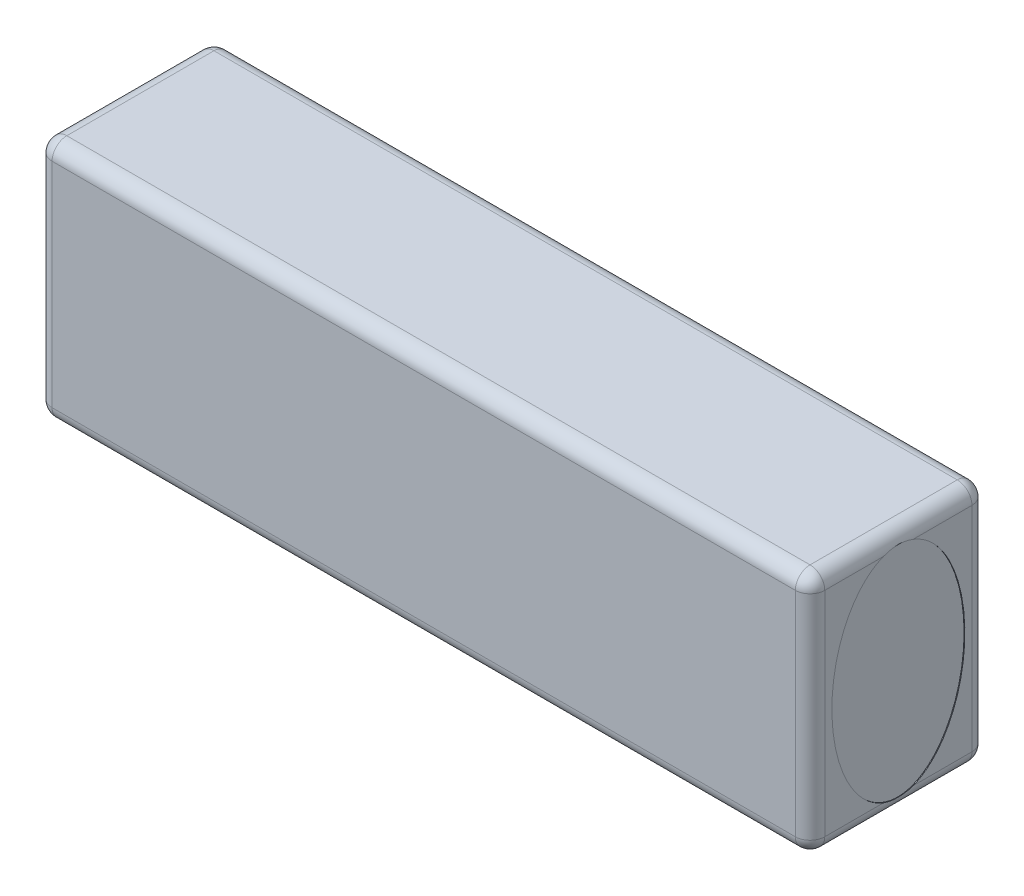
ISO-10303-21;
HEADER;
FILE_DESCRIPTION(('STEP AP214'),'2;1');
FILE_NAME('part.step','',(''),(''),'','','');
FILE_SCHEMA(('AUTOMOTIVE_DESIGN { 1 0 10303 214 1 1 1 1 }'));
ENDSEC;
DATA;
#1=APPLICATION_CONTEXT('core data for automotive mechanical design processes');
#2=APPLICATION_PROTOCOL_DEFINITION('international standard','automotive_design',2000,#1);
#3=PRODUCT_CONTEXT('',#1,'mechanical');
#4=PRODUCT('Part','Part','',(#3));
#5=PRODUCT_RELATED_PRODUCT_CATEGORY('part','',(#4));
#6=PRODUCT_DEFINITION_FORMATION('','',#4);
#7=PRODUCT_DEFINITION_CONTEXT('part definition',#1,'design');
#8=PRODUCT_DEFINITION('design','',#6,#7);
#9=PRODUCT_DEFINITION_SHAPE('','',#8);
#10=(LENGTH_UNIT() NAMED_UNIT(*) SI_UNIT(.MILLI.,.METRE.));
#11=(NAMED_UNIT(*) PLANE_ANGLE_UNIT() SI_UNIT($,.RADIAN.));
#12=(NAMED_UNIT(*) SI_UNIT($,.STERADIAN.) SOLID_ANGLE_UNIT());
#13=UNCERTAINTY_MEASURE_WITH_UNIT(LENGTH_MEASURE(1.E-05),#10,'distance_accuracy_value','');
#14=(GEOMETRIC_REPRESENTATION_CONTEXT(3) GLOBAL_UNCERTAINTY_ASSIGNED_CONTEXT((#13)) GLOBAL_UNIT_ASSIGNED_CONTEXT((#10,
#11,#12)) REPRESENTATION_CONTEXT('',''));
#15=CARTESIAN_POINT('',(0.,0.,0.));
#16=DIRECTION('',(0.,0.,1.));
#17=DIRECTION('',(1.,0.,0.));
#18=AXIS2_PLACEMENT_3D('',#15,#16,#17);
#19=CARTESIAN_POINT('',(105.,0.,24.));
#20=DIRECTION('',(-1.,0.,0.));
#21=DIRECTION('',(0.,0.,1.));
#22=AXIS2_PLACEMENT_3D('',#19,#20,#21);
#23=PLANE('',#22);
#24=CARTESIAN_POINT('',(105.,16.5,12.));
#25=DIRECTION('',(-1.,0.,0.));
#26=DIRECTION('',(0.,1.,0.));
#27=AXIS2_PLACEMENT_3D('',#24,#25,#26);
#28=ELLIPSE('',#27,14.8700467628967,9.03232292091459);
#29=CARTESIAN_POINT('',(105.,31.,9.9975220371461));
#30=VERTEX_POINT('',#29);
#31=CARTESIAN_POINT('',(105.,2.,9.9975220371461));
#32=VERTEX_POINT('',#31);
#33=EDGE_CURVE('E236',#30,#32,#28,.T.);
#34=ORIENTED_EDGE('',*,*,#33,.T.);
#35=DIRECTION('',(0.,0.,-1.));
#36=VECTOR('',#35,1.);
#37=CARTESIAN_POINT('',(105.,2.,24.));
#38=LINE('',#37,#36);
#39=CARTESIAN_POINT('',(105.,2.,2.));
#40=VERTEX_POINT('',#39);
#41=EDGE_CURVE('E322',#32,#40,#38,.T.);
#42=ORIENTED_EDGE('',*,*,#41,.T.);
#43=DIRECTION('',(0.,1.,0.));
#44=VECTOR('',#43,1.);
#45=CARTESIAN_POINT('',(105.,33.,2.));
#46=LINE('',#45,#44);
#47=CARTESIAN_POINT('',(105.,31.,2.));
#48=VERTEX_POINT('',#47);
#49=EDGE_CURVE('E321',#40,#48,#46,.T.);
#50=ORIENTED_EDGE('',*,*,#49,.T.);
#51=DIRECTION('',(0.,0.,-1.));
#52=VECTOR('',#51,1.);
#53=CARTESIAN_POINT('',(105.,31.,24.));
#54=LINE('',#53,#52);
#55=EDGE_CURVE('E319',#48,#30,#54,.F.);
#56=ORIENTED_EDGE('',*,*,#55,.T.);
#57=EDGE_LOOP('',(#34,#42,#50,#56));
#58=FACE_BOUND('',#57,.T.);
#59=ADVANCED_FACE('F33',(#58),#23,.F.);
#60=CARTESIAN_POINT('',(0.,0.,24.));
#61=DIRECTION('',(1.,0.,0.));
#62=DIRECTION('',(0.,0.,-1.));
#63=AXIS2_PLACEMENT_3D('',#60,#61,#62);
#64=PLANE('',#63);
#65=DIRECTION('',(0.,-1.,0.));
#66=VECTOR('',#65,1.);
#67=CARTESIAN_POINT('',(0.,0.,2.));
#68=LINE('',#67,#66);
#69=CARTESIAN_POINT('',(0.,31.,2.));
#70=VERTEX_POINT('',#69);
#71=CARTESIAN_POINT('',(0.,2.,2.));
#72=VERTEX_POINT('',#71);
#73=EDGE_CURVE('E200',#70,#72,#68,.T.);
#74=ORIENTED_EDGE('',*,*,#73,.T.);
#75=DIRECTION('',(0.,0.,-1.));
#76=VECTOR('',#75,1.);
#77=CARTESIAN_POINT('',(0.,2.,24.));
#78=LINE('',#77,#76);
#79=CARTESIAN_POINT('',(0.,2.,9.9975220371461));
#80=VERTEX_POINT('',#79);
#81=EDGE_CURVE('E202',#72,#80,#78,.F.);
#82=ORIENTED_EDGE('',*,*,#81,.T.);
#83=CARTESIAN_POINT('',(0.,16.5,12.));
#84=DIRECTION('',(-1.,0.,0.));
#85=DIRECTION('',(0.,1.,0.));
#86=AXIS2_PLACEMENT_3D('',#83,#84,#85);
#87=ELLIPSE('',#86,14.8700467628967,9.03232292091459);
#88=CARTESIAN_POINT('',(0.,31.,9.9975220371461));
#89=VERTEX_POINT('',#88);
#90=EDGE_CURVE('E186',#89,#80,#87,.T.);
#91=ORIENTED_EDGE('',*,*,#90,.F.);
#92=DIRECTION('',(0.,0.,-1.));
#93=VECTOR('',#92,1.);
#94=CARTESIAN_POINT('',(0.,31.,24.));
#95=LINE('',#94,#93);
#96=EDGE_CURVE('E198',#89,#70,#95,.T.);
#97=ORIENTED_EDGE('',*,*,#96,.T.);
#98=EDGE_LOOP('',(#74,#82,#91,#97));
#99=FACE_BOUND('',#98,.T.);
#100=ADVANCED_FACE('F291',(#99),#64,.F.);
#101=DIRECTION('',(0.,1.,0.));
#102=VECTOR('',#101,1.);
#103=CARTESIAN_POINT('',(105.,0.,22.));
#104=LINE('',#103,#102);
#105=CARTESIAN_POINT('',(105.,31.,22.));
#106=VERTEX_POINT('',#105);
#107=CARTESIAN_POINT('',(105.,2.,22.));
#108=VERTEX_POINT('',#107);
#109=EDGE_CURVE('E310',#106,#108,#104,.F.);
#110=ORIENTED_EDGE('',*,*,#109,.T.);
#111=DIRECTION('',(0.,0.,-1.));
#112=VECTOR('',#111,1.);
#113=CARTESIAN_POINT('',(105.,2.,24.));
#114=LINE('',#113,#112);
#115=CARTESIAN_POINT('',(105.,2.,14.0024779628539));
#116=VERTEX_POINT('',#115);
#117=EDGE_CURVE('E165',#108,#116,#114,.T.);
#118=ORIENTED_EDGE('',*,*,#117,.T.);
#119=CARTESIAN_POINT('',(105.,31.,14.0024779628539));
#120=VERTEX_POINT('',#119);
#121=EDGE_CURVE('E240',#116,#120,#28,.T.);
#122=ORIENTED_EDGE('',*,*,#121,.T.);
#123=DIRECTION('',(0.,0.,-1.));
#124=VECTOR('',#123,1.);
#125=CARTESIAN_POINT('',(105.,31.,24.));
#126=LINE('',#125,#124);
#127=EDGE_CURVE('E314',#120,#106,#126,.F.);
#128=ORIENTED_EDGE('',*,*,#127,.T.);
#129=EDGE_LOOP('',(#110,#118,#122,#128));
#130=FACE_BOUND('',#129,.T.);
#131=ADVANCED_FACE('F294',(#130),#23,.F.);
#132=CARTESIAN_POINT('',(0.,2.,14.0024779628539));
#133=VERTEX_POINT('',#132);
#134=CARTESIAN_POINT('',(0.,31.,14.0024779628539));
#135=VERTEX_POINT('',#134);
#136=EDGE_CURVE('E243',#133,#135,#87,.T.);
#137=ORIENTED_EDGE('',*,*,#136,.F.);
#138=DIRECTION('',(0.,0.,-1.));
#139=VECTOR('',#138,1.);
#140=CARTESIAN_POINT('',(0.,2.,24.));
#141=LINE('',#140,#139);
#142=CARTESIAN_POINT('',(0.,2.,22.));
#143=VERTEX_POINT('',#142);
#144=EDGE_CURVE('E196',#133,#143,#141,.F.);
#145=ORIENTED_EDGE('',*,*,#144,.T.);
#146=DIRECTION('',(0.,-1.,0.));
#147=VECTOR('',#146,1.);
#148=CARTESIAN_POINT('',(0.,0.,22.));
#149=LINE('',#148,#147);
#150=CARTESIAN_POINT('',(0.,31.,22.));
#151=VERTEX_POINT('',#150);
#152=EDGE_CURVE('E192',#143,#151,#149,.F.);
#153=ORIENTED_EDGE('',*,*,#152,.T.);
#154=DIRECTION('',(0.,0.,-1.));
#155=VECTOR('',#154,1.);
#156=CARTESIAN_POINT('',(0.,31.,24.));
#157=LINE('',#156,#155);
#158=EDGE_CURVE('E194',#151,#135,#157,.T.);
#159=ORIENTED_EDGE('',*,*,#158,.T.);
#160=EDGE_LOOP('',(#137,#145,#153,#159));
#161=FACE_BOUND('',#160,.T.);
#162=ADVANCED_FACE('F300',(#161),#64,.F.);
#163=CARTESIAN_POINT('',(0.,0.,24.));
#164=DIRECTION('',(0.,1.,0.));
#165=DIRECTION('',(0.,0.,1.));
#166=AXIS2_PLACEMENT_3D('',#163,#164,#165);
#167=PLANE('',#166);
#168=DIRECTION('',(0.,0.,-1.));
#169=VECTOR('',#168,1.);
#170=CARTESIAN_POINT('',(2.,0.,24.));
#171=LINE('',#170,#169);
#172=CARTESIAN_POINT('',(2.,0.,22.));
#173=VERTEX_POINT('',#172);
#174=CARTESIAN_POINT('',(2.,0.,2.));
#175=VERTEX_POINT('',#174);
#176=EDGE_CURVE('E157',#173,#175,#171,.T.);
#177=ORIENTED_EDGE('',*,*,#176,.T.);
#178=DIRECTION('',(1.,0.,0.));
#179=VECTOR('',#178,1.);
#180=CARTESIAN_POINT('',(105.,0.,2.));
#181=LINE('',#180,#179);
#182=CARTESIAN_POINT('',(103.,0.,2.));
#183=VERTEX_POINT('',#182);
#184=EDGE_CURVE('E153',#175,#183,#181,.T.);
#185=ORIENTED_EDGE('',*,*,#184,.T.);
#186=DIRECTION('',(0.,0.,-1.));
#187=VECTOR('',#186,1.);
#188=CARTESIAN_POINT('',(103.,0.,24.));
#189=LINE('',#188,#187);
#190=CARTESIAN_POINT('',(103.,0.,22.));
#191=VERTEX_POINT('',#190);
#192=EDGE_CURVE('E145',#183,#191,#189,.F.);
#193=ORIENTED_EDGE('',*,*,#192,.T.);
#194=DIRECTION('',(1.,0.,0.));
#195=VECTOR('',#194,1.);
#196=CARTESIAN_POINT('',(0.,0.,22.));
#197=LINE('',#196,#195);
#198=EDGE_CURVE('E150',#191,#173,#197,.F.);
#199=ORIENTED_EDGE('',*,*,#198,.T.);
#200=EDGE_LOOP('',(#177,#185,#193,#199));
#201=FACE_BOUND('',#200,.T.);
#202=ADVANCED_FACE('F148',(#201),#167,.F.);
#203=CARTESIAN_POINT('',(0.,33.,24.));
#204=DIRECTION('',(0.,-1.,0.));
#205=DIRECTION('',(0.,0.,-1.));
#206=AXIS2_PLACEMENT_3D('',#203,#204,#205);
#207=PLANE('',#206);
#208=DIRECTION('',(0.,0.,-1.));
#209=VECTOR('',#208,1.);
#210=CARTESIAN_POINT('',(103.,33.,24.));
#211=LINE('',#210,#209);
#212=CARTESIAN_POINT('',(103.,33.,22.));
#213=VERTEX_POINT('',#212);
#214=CARTESIAN_POINT('',(103.,33.,2.));
#215=VERTEX_POINT('',#214);
#216=EDGE_CURVE('E333',#213,#215,#211,.T.);
#217=ORIENTED_EDGE('',*,*,#216,.T.);
#218=DIRECTION('',(-1.,0.,0.));
#219=VECTOR('',#218,1.);
#220=CARTESIAN_POINT('',(0.,33.,2.));
#221=LINE('',#220,#219);
#222=CARTESIAN_POINT('',(2.,33.,2.));
#223=VERTEX_POINT('',#222);
#224=EDGE_CURVE('E370',#215,#223,#221,.T.);
#225=ORIENTED_EDGE('',*,*,#224,.T.);
#226=DIRECTION('',(0.,0.,-1.));
#227=VECTOR('',#226,1.);
#228=CARTESIAN_POINT('',(2.,33.,24.));
#229=LINE('',#228,#227);
#230=CARTESIAN_POINT('',(2.,33.,22.));
#231=VERTEX_POINT('',#230);
#232=EDGE_CURVE('E367',#223,#231,#229,.F.);
#233=ORIENTED_EDGE('',*,*,#232,.T.);
#234=DIRECTION('',(-1.,0.,0.));
#235=VECTOR('',#234,1.);
#236=CARTESIAN_POINT('',(0.,33.,22.));
#237=LINE('',#236,#235);
#238=EDGE_CURVE('E363',#231,#213,#237,.F.);
#239=ORIENTED_EDGE('',*,*,#238,.T.);
#240=EDGE_LOOP('',(#217,#225,#233,#239));
#241=FACE_BOUND('',#240,.T.);
#242=ADVANCED_FACE('F417',(#241),#207,.F.);
#243=CARTESIAN_POINT('',(0.,0.,24.));
#244=DIRECTION('',(0.,0.,-1.));
#245=DIRECTION('',(-1.,0.,0.));
#246=AXIS2_PLACEMENT_3D('',#243,#244,#245);
#247=PLANE('',#246);
#248=DIRECTION('',(0.,1.,0.));
#249=VECTOR('',#248,1.);
#250=CARTESIAN_POINT('',(103.,0.,24.));
#251=LINE('',#250,#249);
#252=CARTESIAN_POINT('',(103.,2.,24.));
#253=VERTEX_POINT('',#252);
#254=CARTESIAN_POINT('',(103.,31.,24.));
#255=VERTEX_POINT('',#254);
#256=EDGE_CURVE('E43',#253,#255,#251,.T.);
#257=ORIENTED_EDGE('',*,*,#256,.T.);
#258=DIRECTION('',(-1.,0.,0.));
#259=VECTOR('',#258,1.);
#260=CARTESIAN_POINT('',(0.,31.,24.));
#261=LINE('',#260,#259);
#262=CARTESIAN_POINT('',(2.,31.,24.));
#263=VERTEX_POINT('',#262);
#264=EDGE_CURVE('E11',#255,#263,#261,.T.);
#265=ORIENTED_EDGE('',*,*,#264,.T.);
#266=DIRECTION('',(0.,-1.,0.));
#267=VECTOR('',#266,1.);
#268=CARTESIAN_POINT('',(2.,0.,24.));
#269=LINE('',#268,#267);
#270=CARTESIAN_POINT('',(2.,2.,24.));
#271=VERTEX_POINT('',#270);
#272=EDGE_CURVE('E372',#263,#271,#269,.T.);
#273=ORIENTED_EDGE('',*,*,#272,.T.);
#274=DIRECTION('',(1.,0.,0.));
#275=VECTOR('',#274,1.);
#276=CARTESIAN_POINT('',(0.,2.,24.));
#277=LINE('',#276,#275);
#278=EDGE_CURVE('E54',#271,#253,#277,.T.);
#279=ORIENTED_EDGE('',*,*,#278,.T.);
#280=EDGE_LOOP('',(#257,#265,#273,#279));
#281=FACE_BOUND('',#280,.T.);
#282=ADVANCED_FACE('F231',(#281),#247,.F.);
#283=CARTESIAN_POINT('',(0.,0.,0.));
#284=DIRECTION('',(0.,0.,-1.));
#285=DIRECTION('',(-1.,0.,0.));
#286=AXIS2_PLACEMENT_3D('',#283,#284,#285);
#287=PLANE('',#286);
#288=DIRECTION('',(0.,1.,0.));
#289=VECTOR('',#288,1.);
#290=CARTESIAN_POINT('',(103.,0.,0.));
#291=LINE('',#290,#289);
#292=CARTESIAN_POINT('',(103.,31.,0.));
#293=VERTEX_POINT('',#292);
#294=CARTESIAN_POINT('',(103.,2.,0.));
#295=VERTEX_POINT('',#294);
#296=EDGE_CURVE('E354',#293,#295,#291,.F.);
#297=ORIENTED_EDGE('',*,*,#296,.T.);
#298=DIRECTION('',(1.,0.,0.));
#299=VECTOR('',#298,1.);
#300=CARTESIAN_POINT('',(0.,2.,0.));
#301=LINE('',#300,#299);
#302=CARTESIAN_POINT('',(2.,2.,0.));
#303=VERTEX_POINT('',#302);
#304=EDGE_CURVE('E360',#295,#303,#301,.F.);
#305=ORIENTED_EDGE('',*,*,#304,.T.);
#306=DIRECTION('',(0.,-1.,0.));
#307=VECTOR('',#306,1.);
#308=CARTESIAN_POINT('',(2.,33.,0.));
#309=LINE('',#308,#307);
#310=CARTESIAN_POINT('',(2.,31.,0.));
#311=VERTEX_POINT('',#310);
#312=EDGE_CURVE('E361',#303,#311,#309,.F.);
#313=ORIENTED_EDGE('',*,*,#312,.T.);
#314=DIRECTION('',(-1.,0.,0.));
#315=VECTOR('',#314,1.);
#316=CARTESIAN_POINT('',(105.,31.,0.));
#317=LINE('',#316,#315);
#318=EDGE_CURVE('E264',#311,#293,#317,.F.);
#319=ORIENTED_EDGE('',*,*,#318,.T.);
#320=EDGE_LOOP('',(#297,#305,#313,#319));
#321=FACE_BOUND('',#320,.T.);
#322=ADVANCED_FACE('F228',(#321),#287,.T.);
#323=CARTESIAN_POINT('',(0.1,16.5,12.));
#324=DIRECTION('',(-1.,0.,0.));
#325=DIRECTION('',(0.,1.,0.));
#326=AXIS2_PLACEMENT_3D('',#323,#324,#325);
#327=ELLIPSE('',#326,14.8700467628967,9.03232292091459);
#328=DIRECTION('',(-1.,0.,0.));
#329=VECTOR('',#328,1.);
#330=SURFACE_OF_LINEAR_EXTRUSION('',#327,#329);
#331=CARTESIAN_POINT('',(0.1,31.3700467628967,12.));
#332=VERTEX_POINT('',#331);
#333=EDGE_CURVE('E183',#332,#332,#327,.T.);
#334=ORIENTED_EDGE('',*,*,#333,.F.);
#335=EDGE_LOOP('',(#334));
#336=FACE_BOUND('',#335,.T.);
#337=ORIENTED_EDGE('',*,*,#90,.T.);
#338=CARTESIAN_POINT('',(0.,2.,9.9975220371461));
#339=CARTESIAN_POINT('',(1.78552144671845E-05,1.96112195274897,10.1013675729848));
#340=CARTESIAN_POINT('',(0.00113432016049045,1.92504776825726,10.2062608583493));
#341=CARTESIAN_POINT('',(0.00471241749872634,1.85875846496183,10.4179424459383));
#342=CARTESIAN_POINT('',(0.00717500872677033,1.82854754332635,10.5247320463739));
#343=CARTESIAN_POINT('',(0.0125914657694889,1.77428614315386,10.7398814804222));
#344=CARTESIAN_POINT('',(0.0155454438812817,1.75023707599003,10.8482416677834));
#345=CARTESIAN_POINT('',(0.0211508335749181,1.7091855085979,11.0627832842933));
#346=CARTESIAN_POINT('',(0.0238088194882313,1.69198610647213,11.1689268281024));
#347=CARTESIAN_POINT('',(0.0284157002313787,1.66375559360656,11.3820153433492));
#348=CARTESIAN_POINT('',(0.0303648208043361,1.65272251855497,11.4889600485594));
#349=CARTESIAN_POINT('',(0.0332148597554768,1.63692892707625,11.7033002229462));
#350=CARTESIAN_POINT('',(0.0341160300933108,1.63216690285806,11.8106955775381));
#351=CARTESIAN_POINT('',(0.0347423240916354,1.62882994802029,12.0343682728562));
#352=CARTESIAN_POINT('',(0.0343653363912083,1.6307923580693,12.1506543336419));
#353=CARTESIAN_POINT('',(0.032277529148235,1.64208890878767,12.3828968981739));
#354=CARTESIAN_POINT('',(0.0305662056119108,1.65142583491266,12.4988532607762));
#355=CARTESIAN_POINT('',(0.0261505514455637,1.67736833552321,12.7299786422421));
#356=CARTESIAN_POINT('',(0.0234457868834972,1.69397708692987,12.8451472946101));
#357=CARTESIAN_POINT('',(0.0175253679275907,1.73497916692446,13.0782256855976));
#358=CARTESIAN_POINT('',(0.0142951735089593,1.75962403814143,13.196090739159));
#359=CARTESIAN_POINT('',(0.00825748383073866,1.81621486850696,13.430025384691));
#360=CARTESIAN_POINT('',(0.00544986614824383,1.84815870632375,13.5460954878919));
#361=CARTESIAN_POINT('',(0.00133436397770318,1.9189725192142,13.7760130051417));
#362=CARTESIAN_POINT('',(2.50967533597147E-05,1.95783607016235,13.8898623730242));
#363=CARTESIAN_POINT('',(0.,2.,14.0024779628539));
#364=B_SPLINE_CURVE_WITH_KNOTS('',3,(#338,#339,#340,#341,#342,#343,#344,#345,#346,#347,#348,
#349,#350,#351,#352,#353,#354,#355,#356,#357,#358,#359,#360,#361,#362,#363),.UNSPECIFIED.,.F.,
.F.,(4,2,2,2,2,2,2,2,2,2,2,2,4),(0.,0.332607157635862,0.665451538198268,0.998372088771618,
1.32087793450659,1.64328098588188,1.96560650555412,2.31426921943045,2.66306369100164,
3.01201069648114,3.37314071972117,3.73416591930599,4.09485768139826),.UNSPECIFIED.);
#365=EDGE_CURVE('E212',#80,#133,#364,.T.);
#366=ORIENTED_EDGE('',*,*,#365,.T.);
#367=ORIENTED_EDGE('',*,*,#136,.T.);
#368=CARTESIAN_POINT('',(0.,31.,14.0024779628539));
#369=CARTESIAN_POINT('',(1.78552144673045E-05,31.038878047251,13.8986324270152));
#370=CARTESIAN_POINT('',(0.00113432016049053,31.0749522317427,13.7937391416507));
#371=CARTESIAN_POINT('',(0.00471241749872629,31.1412415350382,13.5820575540617));
#372=CARTESIAN_POINT('',(0.00717500872677018,31.1714524566737,13.4752679536261));
#373=CARTESIAN_POINT('',(0.0125914657694888,31.2257138568461,13.2601185195778));
#374=CARTESIAN_POINT('',(0.0155454438812818,31.24976292401,13.1517583322166));
#375=CARTESIAN_POINT('',(0.0211508335749186,31.2908144914021,12.9372167157067));
#376=CARTESIAN_POINT('',(0.023808819488232,31.3080138935279,12.8310731718976));
#377=CARTESIAN_POINT('',(0.0284157002313792,31.3362444063934,12.6179846566508));
#378=CARTESIAN_POINT('',(0.0303648208043361,31.347277481445,12.5110399514406));
#379=CARTESIAN_POINT('',(0.0332148597554769,31.3630710729237,12.2966997770538));
#380=CARTESIAN_POINT('',(0.0341160300933115,31.3678330971419,12.1893044224619));
#381=CARTESIAN_POINT('',(0.0347423240916365,31.3711700519797,11.9656317271438));
#382=CARTESIAN_POINT('',(0.0343653363912092,31.3692076419307,11.8493456663581));
#383=CARTESIAN_POINT('',(0.0322775291482354,31.3579110912123,11.6171031018261));
#384=CARTESIAN_POINT('',(0.030566205611911,31.3485741650873,11.5011467392238));
#385=CARTESIAN_POINT('',(0.026150551445564,31.3226316644768,11.270021357758));
#386=CARTESIAN_POINT('',(0.0234457868834979,31.3060229130701,11.1548527053899));
#387=CARTESIAN_POINT('',(0.0175253679275913,31.2650208330755,10.9217743144024));
#388=CARTESIAN_POINT('',(0.0142951735089596,31.2403759618586,10.803909260841));
#389=CARTESIAN_POINT('',(0.00825748383073859,31.183785131493,10.5699746153089));
#390=CARTESIAN_POINT('',(0.00544986614824381,31.1518412936763,10.4539045121081));
#391=CARTESIAN_POINT('',(0.0013343639777032,31.0810274807858,10.2239869948583));
#392=CARTESIAN_POINT('',(2.50967533597439E-05,31.0421639298377,10.1101376269758));
#393=CARTESIAN_POINT('',(0.,31.,9.9975220371461));
#394=B_SPLINE_CURVE_WITH_KNOTS('',3,(#368,#369,#370,#371,#372,#373,#374,#375,#376,#377,#378,
#379,#380,#381,#382,#383,#384,#385,#386,#387,#388,#389,#390,#391,#392,#393),.UNSPECIFIED.,.F.,
.F.,(4,2,2,2,2,2,2,2,2,2,2,2,4),(0.,0.332607157635863,0.665451538198266,0.998372088771615,
1.32087793450659,1.64328098588188,1.96560650555411,2.31426921943044,2.66306369100163,
3.01201069648114,3.37314071972117,3.734165919306,4.09485768139826),.UNSPECIFIED.);
#395=EDGE_CURVE('E205',#135,#89,#394,.T.);
#396=ORIENTED_EDGE('',*,*,#395,.T.);
#397=EDGE_LOOP('',(#337,#366,#367,#396));
#398=FACE_BOUND('',#397,.T.);
#399=ADVANCED_FACE('F222',(#336,#398),#330,.F.);
#400=CARTESIAN_POINT('',(0.1,16.5,12.));
#401=DIRECTION('',(-1.,0.,0.));
#402=DIRECTION('',(0.,0.,1.));
#403=AXIS2_PLACEMENT_3D('',#400,#401,#402);
#404=PLANE('',#403);
#405=ORIENTED_EDGE('',*,*,#333,.T.);
#406=EDGE_LOOP('',(#405));
#407=FACE_BOUND('',#406,.T.);
#408=ADVANCED_FACE('F227',(#407),#404,.T.);
#409=CARTESIAN_POINT('',(104.9,16.5,12.));
#410=DIRECTION('',(-1.,0.,0.));
#411=DIRECTION('',(0.,1.,0.));
#412=AXIS2_PLACEMENT_3D('',#409,#410,#411);
#413=ELLIPSE('',#412,14.8700467628967,9.03232292091459);
#414=DIRECTION('',(1.,0.,0.));
#415=VECTOR('',#414,1.);
#416=SURFACE_OF_LINEAR_EXTRUSION('',#413,#415);
#417=CARTESIAN_POINT('',(104.9,31.3700467628967,12.));
#418=VERTEX_POINT('',#417);
#419=EDGE_CURVE('E239',#418,#418,#413,.T.);
#420=ORIENTED_EDGE('',*,*,#419,.T.);
#421=EDGE_LOOP('',(#420));
#422=FACE_BOUND('',#421,.T.);
#423=ORIENTED_EDGE('',*,*,#121,.F.);
#424=CARTESIAN_POINT('',(105.,2.,14.0024779628539));
#425=CARTESIAN_POINT('',(104.999982144786,1.96112195274897,13.8986324270152));
#426=CARTESIAN_POINT('',(104.998865679839,1.92504776825726,13.7937391416507));
#427=CARTESIAN_POINT('',(104.995287582501,1.85875846496183,13.5820575540617));
#428=CARTESIAN_POINT('',(104.992824991273,1.82854754332635,13.4752679536261));
#429=CARTESIAN_POINT('',(104.98740853423,1.77428614315386,13.2601185195779));
#430=CARTESIAN_POINT('',(104.984454556119,1.75023707599003,13.1517583322166));
#431=CARTESIAN_POINT('',(104.978849166425,1.7091855085979,12.9372167157067));
#432=CARTESIAN_POINT('',(104.976191180512,1.69198610647213,12.8310731718976));
#433=CARTESIAN_POINT('',(104.971584299769,1.66375559360656,12.6179846566508));
#434=CARTESIAN_POINT('',(104.969635179196,1.65272251855497,12.5110399514406));
#435=CARTESIAN_POINT('',(104.966785140245,1.63692892707625,12.2966997770538));
#436=CARTESIAN_POINT('',(104.965883969907,1.63216690285806,12.1893044224619));
#437=CARTESIAN_POINT('',(104.965257675908,1.62882994802029,11.9656317271438));
#438=CARTESIAN_POINT('',(104.965634663609,1.6307923580693,11.8493456663581));
#439=CARTESIAN_POINT('',(104.967722470852,1.64208890878767,11.6171031018261));
#440=CARTESIAN_POINT('',(104.969433794388,1.65142583491266,11.5011467392238));
#441=CARTESIAN_POINT('',(104.973849448554,1.67736833552321,11.270021357758));
#442=CARTESIAN_POINT('',(104.976554213117,1.69397708692986,11.1548527053899));
#443=CARTESIAN_POINT('',(104.982474632072,1.73497916692445,10.9217743144024));
#444=CARTESIAN_POINT('',(104.985704826491,1.75962403814143,10.803909260841));
#445=CARTESIAN_POINT('',(104.991742516169,1.81621486850695,10.569974615309));
#446=CARTESIAN_POINT('',(104.994550133852,1.84815870632375,10.4539045121081));
#447=CARTESIAN_POINT('',(104.998665636022,1.9189725192142,10.2239869948583));
#448=CARTESIAN_POINT('',(104.999974903247,1.95783607016235,10.1101376269758));
#449=CARTESIAN_POINT('',(105.,2.,9.9975220371461));
#450=B_SPLINE_CURVE_WITH_KNOTS('',3,(#424,#425,#426,#427,#428,#429,#430,#431,#432,#433,#434,
#435,#436,#437,#438,#439,#440,#441,#442,#443,#444,#445,#446,#447,#448,#449),.UNSPECIFIED.,.F.,
.F.,(4,2,2,2,2,2,2,2,2,2,2,2,4),(0.,0.332607157635862,0.665451538198264,0.998372088771613,
1.32087793450659,1.64328098588188,1.96560650555411,2.31426921943044,2.66306369100163,
3.01201069648113,3.37314071972116,3.73416591930599,4.09485768139826),.UNSPECIFIED.);
#451=EDGE_CURVE('E258',#116,#32,#450,.T.);
#452=ORIENTED_EDGE('',*,*,#451,.T.);
#453=ORIENTED_EDGE('',*,*,#33,.F.);
#454=CARTESIAN_POINT('',(105.,31.,9.9975220371461));
#455=CARTESIAN_POINT('',(104.999982144786,31.038878047251,10.1013675729848));
#456=CARTESIAN_POINT('',(104.998865679839,31.0749522317427,10.2062608583493));
#457=CARTESIAN_POINT('',(104.995287582501,31.1412415350382,10.4179424459383));
#458=CARTESIAN_POINT('',(104.992824991273,31.1714524566737,10.5247320463739));
#459=CARTESIAN_POINT('',(104.98740853423,31.2257138568461,10.7398814804222));
#460=CARTESIAN_POINT('',(104.984454556119,31.24976292401,10.8482416677834));
#461=CARTESIAN_POINT('',(104.978849166425,31.2908144914021,11.0627832842933));
#462=CARTESIAN_POINT('',(104.976191180512,31.3080138935279,11.1689268281024));
#463=CARTESIAN_POINT('',(104.971584299769,31.3362444063934,11.3820153433492));
#464=CARTESIAN_POINT('',(104.969635179196,31.347277481445,11.4889600485594));
#465=CARTESIAN_POINT('',(104.966785140245,31.3630710729237,11.7033002229462));
#466=CARTESIAN_POINT('',(104.965883969907,31.3678330971419,11.8106955775381));
#467=CARTESIAN_POINT('',(104.965257675908,31.3711700519797,12.0343682728562));
#468=CARTESIAN_POINT('',(104.965634663609,31.3692076419307,12.1506543336419));
#469=CARTESIAN_POINT('',(104.967722470852,31.3579110912123,12.3828968981739));
#470=CARTESIAN_POINT('',(104.969433794388,31.3485741650873,12.4988532607762));
#471=CARTESIAN_POINT('',(104.973849448554,31.3226316644768,12.729978642242));
#472=CARTESIAN_POINT('',(104.976554213117,31.3060229130701,12.8451472946101));
#473=CARTESIAN_POINT('',(104.982474632072,31.2650208330755,13.0782256855976));
#474=CARTESIAN_POINT('',(104.985704826491,31.2403759618586,13.196090739159));
#475=CARTESIAN_POINT('',(104.991742516169,31.183785131493,13.430025384691));
#476=CARTESIAN_POINT('',(104.994550133852,31.1518412936763,13.5460954878919));
#477=CARTESIAN_POINT('',(104.998665636022,31.0810274807858,13.7760130051417));
#478=CARTESIAN_POINT('',(104.999974903247,31.0421639298376,13.8898623730242));
#479=CARTESIAN_POINT('',(105.,31.,14.0024779628539));
#480=B_SPLINE_CURVE_WITH_KNOTS('',3,(#454,#455,#456,#457,#458,#459,#460,#461,#462,#463,#464,
#465,#466,#467,#468,#469,#470,#471,#472,#473,#474,#475,#476,#477,#478,#479),.UNSPECIFIED.,.F.,
.F.,(4,2,2,2,2,2,2,2,2,2,2,2,4),(0.,0.332607157635863,0.665451538198266,0.998372088771616,
1.32087793450659,1.64328098588188,1.96560650555412,2.31426921943044,2.66306369100164,
3.01201069648114,3.37314071972117,3.73416591930599,4.09485768139826),.UNSPECIFIED.);
#481=EDGE_CURVE('E252',#30,#120,#480,.T.);
#482=ORIENTED_EDGE('',*,*,#481,.T.);
#483=EDGE_LOOP('',(#423,#452,#453,#482));
#484=FACE_BOUND('',#483,.T.);
#485=ADVANCED_FACE('F244',(#422,#484),#416,.T.);
#486=CARTESIAN_POINT('',(104.9,16.5,12.));
#487=DIRECTION('',(1.,0.,0.));
#488=DIRECTION('',(0.,0.,1.));
#489=AXIS2_PLACEMENT_3D('',#486,#487,#488);
#490=PLANE('',#489);
#491=ORIENTED_EDGE('',*,*,#419,.F.);
#492=EDGE_LOOP('',(#491));
#493=FACE_BOUND('',#492,.T.);
#494=ADVANCED_FACE('F248',(#493),#490,.T.);
#495=CARTESIAN_POINT('',(103.,31.,24.));
#496=DIRECTION('',(0.,0.,-1.));
#497=DIRECTION('',(-1.,0.,0.));
#498=AXIS2_PLACEMENT_3D('',#495,#496,#497);
#499=CYLINDRICAL_SURFACE('',#498,2.);
#500=CARTESIAN_POINT('',(103.,31.,22.));
#501=DIRECTION('',(0.,0.,1.));
#502=DIRECTION('',(1.,0.,0.));
#503=AXIS2_PLACEMENT_3D('',#500,#501,#502);
#504=CIRCLE('',#503,2.);
#505=EDGE_CURVE('E38',#106,#213,#504,.T.);
#506=ORIENTED_EDGE('',*,*,#505,.F.);
#507=ORIENTED_EDGE('',*,*,#127,.F.);
#508=ORIENTED_EDGE('',*,*,#481,.F.);
#509=ORIENTED_EDGE('',*,*,#55,.F.);
#510=CARTESIAN_POINT('',(103.,31.,2.));
#511=DIRECTION('',(0.,0.,-1.));
#512=DIRECTION('',(-1.,0.,0.));
#513=AXIS2_PLACEMENT_3D('',#510,#511,#512);
#514=CIRCLE('',#513,2.);
#515=EDGE_CURVE('E336',#215,#48,#514,.T.);
#516=ORIENTED_EDGE('',*,*,#515,.F.);
#517=ORIENTED_EDGE('',*,*,#216,.F.);
#518=EDGE_LOOP('',(#506,#507,#508,#509,#516,#517));
#519=FACE_BOUND('',#518,.T.);
#520=ADVANCED_FACE('F35',(#519),#499,.T.);
#521=CARTESIAN_POINT('',(103.,31.,22.));
#522=DIRECTION('',(0.,0.,1.));
#523=DIRECTION('',(1.,0.,0.));
#524=AXIS2_PLACEMENT_3D('',#521,#522,#523);
#525=SPHERICAL_SURFACE('',#524,2.);
#526=CARTESIAN_POINT('',(103.,31.,22.));
#527=DIRECTION('',(0.,1.,0.));
#528=DIRECTION('',(0.,0.,1.));
#529=AXIS2_PLACEMENT_3D('',#526,#527,#528);
#530=CIRCLE('',#529,2.);
#531=EDGE_CURVE('E337',#106,#255,#530,.F.);
#532=ORIENTED_EDGE('',*,*,#531,.F.);
#533=ORIENTED_EDGE('',*,*,#505,.T.);
#534=CARTESIAN_POINT('',(103.,31.,22.));
#535=DIRECTION('',(1.,0.,0.));
#536=DIRECTION('',(0.,0.,-1.));
#537=AXIS2_PLACEMENT_3D('',#534,#535,#536);
#538=CIRCLE('',#537,2.);
#539=EDGE_CURVE('E338',#255,#213,#538,.F.);
#540=ORIENTED_EDGE('',*,*,#539,.F.);
#541=EDGE_LOOP('',(#532,#533,#540));
#542=FACE_BOUND('',#541,.T.);
#543=ADVANCED_FACE('F281',(#542),#525,.T.);
#544=CARTESIAN_POINT('',(103.,31.,2.));
#545=DIRECTION('',(0.,0.,1.));
#546=DIRECTION('',(1.,0.,0.));
#547=AXIS2_PLACEMENT_3D('',#544,#545,#546);
#548=SPHERICAL_SURFACE('',#547,2.);
#549=CARTESIAN_POINT('',(103.,31.,2.));
#550=DIRECTION('',(1.,0.,0.));
#551=DIRECTION('',(0.,0.,-1.));
#552=AXIS2_PLACEMENT_3D('',#549,#550,#551);
#553=CIRCLE('',#552,2.);
#554=EDGE_CURVE('E344',#215,#293,#553,.F.);
#555=ORIENTED_EDGE('',*,*,#554,.F.);
#556=ORIENTED_EDGE('',*,*,#515,.T.);
#557=CARTESIAN_POINT('',(103.,31.,2.));
#558=DIRECTION('',(0.,1.,0.));
#559=DIRECTION('',(0.,0.,1.));
#560=AXIS2_PLACEMENT_3D('',#557,#558,#559);
#561=CIRCLE('',#560,2.);
#562=EDGE_CURVE('E340',#293,#48,#561,.F.);
#563=ORIENTED_EDGE('',*,*,#562,.F.);
#564=EDGE_LOOP('',(#555,#556,#563));
#565=FACE_BOUND('',#564,.T.);
#566=ADVANCED_FACE('F278',(#565),#548,.T.);
#567=CARTESIAN_POINT('',(0.,31.,22.));
#568=DIRECTION('',(-1.,0.,0.));
#569=DIRECTION('',(0.,0.,1.));
#570=AXIS2_PLACEMENT_3D('',#567,#568,#569);
#571=CYLINDRICAL_SURFACE('',#570,2.);
#572=ORIENTED_EDGE('',*,*,#539,.T.);
#573=ORIENTED_EDGE('',*,*,#238,.F.);
#574=CARTESIAN_POINT('',(2.,31.,22.));
#575=DIRECTION('',(-1.,0.,0.));
#576=DIRECTION('',(0.,0.,1.));
#577=AXIS2_PLACEMENT_3D('',#574,#575,#576);
#578=CIRCLE('',#577,2.);
#579=EDGE_CURVE('E406',#263,#231,#578,.T.);
#580=ORIENTED_EDGE('',*,*,#579,.F.);
#581=ORIENTED_EDGE('',*,*,#264,.F.);
#582=EDGE_LOOP('',(#572,#573,#580,#581));
#583=FACE_BOUND('',#582,.T.);
#584=ADVANCED_FACE('F274',(#583),#571,.T.);
#585=CARTESIAN_POINT('',(103.,0.,22.));
#586=DIRECTION('',(0.,1.,0.));
#587=DIRECTION('',(0.,0.,1.));
#588=AXIS2_PLACEMENT_3D('',#585,#586,#587);
#589=CYLINDRICAL_SURFACE('',#588,2.);
#590=ORIENTED_EDGE('',*,*,#531,.T.);
#591=ORIENTED_EDGE('',*,*,#256,.F.);
#592=CARTESIAN_POINT('',(103.,2.,22.));
#593=DIRECTION('',(0.,-1.,0.));
#594=DIRECTION('',(0.,0.,-1.));
#595=AXIS2_PLACEMENT_3D('',#592,#593,#594);
#596=CIRCLE('',#595,2.);
#597=EDGE_CURVE('E169',#108,#253,#596,.T.);
#598=ORIENTED_EDGE('',*,*,#597,.F.);
#599=ORIENTED_EDGE('',*,*,#109,.F.);
#600=EDGE_LOOP('',(#590,#591,#598,#599));
#601=FACE_BOUND('',#600,.T.);
#602=ADVANCED_FACE('F271',(#601),#589,.T.);
#603=CARTESIAN_POINT('',(103.,2.,24.));
#604=DIRECTION('',(0.,0.,-1.));
#605=DIRECTION('',(-1.,0.,0.));
#606=AXIS2_PLACEMENT_3D('',#603,#604,#605);
#607=CYLINDRICAL_SURFACE('',#606,2.);
#608=ORIENTED_EDGE('',*,*,#451,.F.);
#609=ORIENTED_EDGE('',*,*,#117,.F.);
#610=CARTESIAN_POINT('',(103.,2.,22.));
#611=DIRECTION('',(0.,0.,1.));
#612=DIRECTION('',(1.,0.,0.));
#613=AXIS2_PLACEMENT_3D('',#610,#611,#612);
#614=CIRCLE('',#613,2.);
#615=EDGE_CURVE('E161',#191,#108,#614,.T.);
#616=ORIENTED_EDGE('',*,*,#615,.F.);
#617=ORIENTED_EDGE('',*,*,#192,.F.);
#618=CARTESIAN_POINT('',(103.,2.,2.));
#619=DIRECTION('',(0.,0.,-1.));
#620=DIRECTION('',(-1.,0.,0.));
#621=AXIS2_PLACEMENT_3D('',#618,#619,#620);
#622=CIRCLE('',#621,2.);
#623=EDGE_CURVE('E170',#40,#183,#622,.T.);
#624=ORIENTED_EDGE('',*,*,#623,.F.);
#625=ORIENTED_EDGE('',*,*,#41,.F.);
#626=EDGE_LOOP('',(#608,#609,#616,#617,#624,#625));
#627=FACE_BOUND('',#626,.T.);
#628=ADVANCED_FACE('F163',(#627),#607,.T.);
#629=CARTESIAN_POINT('',(103.,0.,2.));
#630=DIRECTION('',(0.,-1.,0.));
#631=DIRECTION('',(0.,0.,-1.));
#632=AXIS2_PLACEMENT_3D('',#629,#630,#631);
#633=CYLINDRICAL_SURFACE('',#632,2.);
#634=ORIENTED_EDGE('',*,*,#562,.T.);
#635=ORIENTED_EDGE('',*,*,#49,.F.);
#636=CARTESIAN_POINT('',(103.,2.,2.));
#637=DIRECTION('',(0.,-1.,0.));
#638=DIRECTION('',(0.,0.,-1.));
#639=AXIS2_PLACEMENT_3D('',#636,#637,#638);
#640=CIRCLE('',#639,2.);
#641=EDGE_CURVE('E356',#295,#40,#640,.T.);
#642=ORIENTED_EDGE('',*,*,#641,.F.);
#643=ORIENTED_EDGE('',*,*,#296,.F.);
#644=EDGE_LOOP('',(#634,#635,#642,#643));
#645=FACE_BOUND('',#644,.T.);
#646=ADVANCED_FACE('F270',(#645),#633,.T.);
#647=CARTESIAN_POINT('',(0.,31.,2.));
#648=DIRECTION('',(1.,0.,0.));
#649=DIRECTION('',(0.,0.,-1.));
#650=AXIS2_PLACEMENT_3D('',#647,#648,#649);
#651=CYLINDRICAL_SURFACE('',#650,2.);
#652=ORIENTED_EDGE('',*,*,#554,.T.);
#653=ORIENTED_EDGE('',*,*,#318,.F.);
#654=CARTESIAN_POINT('',(2.,31.,2.));
#655=DIRECTION('',(-1.,0.,0.));
#656=DIRECTION('',(0.,0.,1.));
#657=AXIS2_PLACEMENT_3D('',#654,#655,#656);
#658=CIRCLE('',#657,2.);
#659=EDGE_CURVE('E400',#223,#311,#658,.T.);
#660=ORIENTED_EDGE('',*,*,#659,.F.);
#661=ORIENTED_EDGE('',*,*,#224,.F.);
#662=EDGE_LOOP('',(#652,#653,#660,#661));
#663=FACE_BOUND('',#662,.T.);
#664=ADVANCED_FACE('F413',(#663),#651,.T.);
#665=CARTESIAN_POINT('',(2.,31.,24.));
#666=DIRECTION('',(0.,0.,-1.));
#667=DIRECTION('',(-1.,0.,0.));
#668=AXIS2_PLACEMENT_3D('',#665,#666,#667);
#669=CYLINDRICAL_SURFACE('',#668,2.);
#670=CARTESIAN_POINT('',(2.,31.,22.));
#671=DIRECTION('',(0.,0.,1.));
#672=DIRECTION('',(1.,0.,0.));
#673=AXIS2_PLACEMENT_3D('',#670,#671,#672);
#674=CIRCLE('',#673,2.);
#675=EDGE_CURVE('E409',#231,#151,#674,.T.);
#676=ORIENTED_EDGE('',*,*,#675,.F.);
#677=ORIENTED_EDGE('',*,*,#232,.F.);
#678=CARTESIAN_POINT('',(2.,31.,2.));
#679=DIRECTION('',(0.,0.,-1.));
#680=DIRECTION('',(-1.,0.,0.));
#681=AXIS2_PLACEMENT_3D('',#678,#679,#680);
#682=CIRCLE('',#681,2.);
#683=EDGE_CURVE('E397',#70,#223,#682,.T.);
#684=ORIENTED_EDGE('',*,*,#683,.F.);
#685=ORIENTED_EDGE('',*,*,#96,.F.);
#686=ORIENTED_EDGE('',*,*,#395,.F.);
#687=ORIENTED_EDGE('',*,*,#158,.F.);
#688=EDGE_LOOP('',(#676,#677,#684,#685,#686,#687));
#689=FACE_BOUND('',#688,.T.);
#690=ADVANCED_FACE('F218',(#689),#669,.T.);
#691=CARTESIAN_POINT('',(2.,31.,22.));
#692=DIRECTION('',(0.,0.,1.));
#693=DIRECTION('',(1.,0.,0.));
#694=AXIS2_PLACEMENT_3D('',#691,#692,#693);
#695=SPHERICAL_SURFACE('',#694,2.);
#696=ORIENTED_EDGE('',*,*,#579,.T.);
#697=ORIENTED_EDGE('',*,*,#675,.T.);
#698=CARTESIAN_POINT('',(2.,31.,22.));
#699=DIRECTION('',(0.,1.,0.));
#700=DIRECTION('',(0.,0.,1.));
#701=AXIS2_PLACEMENT_3D('',#698,#699,#700);
#702=CIRCLE('',#701,2.);
#703=EDGE_CURVE('E176',#263,#151,#702,.F.);
#704=ORIENTED_EDGE('',*,*,#703,.F.);
#705=EDGE_LOOP('',(#696,#697,#704));
#706=FACE_BOUND('',#705,.T.);
#707=ADVANCED_FACE('F429',(#706),#695,.T.);
#708=CARTESIAN_POINT('',(103.,2.,22.));
#709=DIRECTION('',(0.,0.,1.));
#710=DIRECTION('',(1.,0.,0.));
#711=AXIS2_PLACEMENT_3D('',#708,#709,#710);
#712=SPHERICAL_SURFACE('',#711,2.);
#713=ORIENTED_EDGE('',*,*,#615,.T.);
#714=ORIENTED_EDGE('',*,*,#597,.T.);
#715=CARTESIAN_POINT('',(103.,2.,22.));
#716=DIRECTION('',(1.,0.,0.));
#717=DIRECTION('',(0.,0.,-1.));
#718=AXIS2_PLACEMENT_3D('',#715,#716,#717);
#719=CIRCLE('',#718,2.);
#720=EDGE_CURVE('E173',#191,#253,#719,.F.);
#721=ORIENTED_EDGE('',*,*,#720,.F.);
#722=EDGE_LOOP('',(#713,#714,#721));
#723=FACE_BOUND('',#722,.T.);
#724=ADVANCED_FACE('F174',(#723),#712,.T.);
#725=CARTESIAN_POINT('',(103.,2.,2.));
#726=DIRECTION('',(0.,0.,1.));
#727=DIRECTION('',(1.,0.,0.));
#728=AXIS2_PLACEMENT_3D('',#725,#726,#727);
#729=SPHERICAL_SURFACE('',#728,2.);
#730=ORIENTED_EDGE('',*,*,#641,.T.);
#731=ORIENTED_EDGE('',*,*,#623,.T.);
#732=CARTESIAN_POINT('',(103.,2.,2.));
#733=DIRECTION('',(1.,0.,0.));
#734=DIRECTION('',(0.,0.,-1.));
#735=AXIS2_PLACEMENT_3D('',#732,#733,#734);
#736=CIRCLE('',#735,2.);
#737=EDGE_CURVE('E177',#295,#183,#736,.F.);
#738=ORIENTED_EDGE('',*,*,#737,.F.);
#739=EDGE_LOOP('',(#730,#731,#738));
#740=FACE_BOUND('',#739,.T.);
#741=ADVANCED_FACE('F451',(#740),#729,.T.);
#742=CARTESIAN_POINT('',(2.,31.,2.));
#743=DIRECTION('',(0.,0.,1.));
#744=DIRECTION('',(1.,0.,0.));
#745=AXIS2_PLACEMENT_3D('',#742,#743,#744);
#746=SPHERICAL_SURFACE('',#745,2.);
#747=ORIENTED_EDGE('',*,*,#683,.T.);
#748=ORIENTED_EDGE('',*,*,#659,.T.);
#749=CARTESIAN_POINT('',(2.,31.,2.));
#750=DIRECTION('',(0.,1.,0.));
#751=DIRECTION('',(0.,0.,1.));
#752=AXIS2_PLACEMENT_3D('',#749,#750,#751);
#753=CIRCLE('',#752,2.);
#754=EDGE_CURVE('E390',#70,#311,#753,.F.);
#755=ORIENTED_EDGE('',*,*,#754,.F.);
#756=EDGE_LOOP('',(#747,#748,#755));
#757=FACE_BOUND('',#756,.T.);
#758=ADVANCED_FACE('F453',(#757),#746,.T.);
#759=CARTESIAN_POINT('',(2.,0.,22.));
#760=DIRECTION('',(0.,-1.,0.));
#761=DIRECTION('',(0.,0.,-1.));
#762=AXIS2_PLACEMENT_3D('',#759,#760,#761);
#763=CYLINDRICAL_SURFACE('',#762,2.);
#764=ORIENTED_EDGE('',*,*,#703,.T.);
#765=ORIENTED_EDGE('',*,*,#152,.F.);
#766=CARTESIAN_POINT('',(2.,2.,22.));
#767=DIRECTION('',(0.,-1.,0.));
#768=DIRECTION('',(0.,0.,-1.));
#769=AXIS2_PLACEMENT_3D('',#766,#767,#768);
#770=CIRCLE('',#769,2.);
#771=EDGE_CURVE('E387',#271,#143,#770,.T.);
#772=ORIENTED_EDGE('',*,*,#771,.F.);
#773=ORIENTED_EDGE('',*,*,#272,.F.);
#774=EDGE_LOOP('',(#764,#765,#772,#773));
#775=FACE_BOUND('',#774,.T.);
#776=ADVANCED_FACE('F433',(#775),#763,.T.);
#777=CARTESIAN_POINT('',(0.,2.,22.));
#778=DIRECTION('',(1.,0.,0.));
#779=DIRECTION('',(0.,0.,-1.));
#780=AXIS2_PLACEMENT_3D('',#777,#778,#779);
#781=CYLINDRICAL_SURFACE('',#780,2.);
#782=ORIENTED_EDGE('',*,*,#720,.T.);
#783=ORIENTED_EDGE('',*,*,#278,.F.);
#784=CARTESIAN_POINT('',(2.,2.,22.));
#785=DIRECTION('',(-1.,0.,0.));
#786=DIRECTION('',(0.,0.,1.));
#787=AXIS2_PLACEMENT_3D('',#784,#785,#786);
#788=CIRCLE('',#787,2.);
#789=EDGE_CURVE('E181',#173,#271,#788,.T.);
#790=ORIENTED_EDGE('',*,*,#789,.F.);
#791=ORIENTED_EDGE('',*,*,#198,.F.);
#792=EDGE_LOOP('',(#782,#783,#790,#791));
#793=FACE_BOUND('',#792,.T.);
#794=ADVANCED_FACE('F179',(#793),#781,.T.);
#795=CARTESIAN_POINT('',(0.,2.,2.));
#796=DIRECTION('',(-1.,0.,0.));
#797=DIRECTION('',(0.,0.,1.));
#798=AXIS2_PLACEMENT_3D('',#795,#796,#797);
#799=CYLINDRICAL_SURFACE('',#798,2.);
#800=ORIENTED_EDGE('',*,*,#737,.T.);
#801=ORIENTED_EDGE('',*,*,#184,.F.);
#802=CARTESIAN_POINT('',(2.,2.,2.));
#803=DIRECTION('',(-1.,0.,0.));
#804=DIRECTION('',(0.,0.,1.));
#805=AXIS2_PLACEMENT_3D('',#802,#803,#804);
#806=CIRCLE('',#805,2.);
#807=EDGE_CURVE('E383',#303,#175,#806,.T.);
#808=ORIENTED_EDGE('',*,*,#807,.F.);
#809=ORIENTED_EDGE('',*,*,#304,.F.);
#810=EDGE_LOOP('',(#800,#801,#808,#809));
#811=FACE_BOUND('',#810,.T.);
#812=ADVANCED_FACE('F449',(#811),#799,.T.);
#813=CARTESIAN_POINT('',(2.,0.,2.));
#814=DIRECTION('',(0.,1.,0.));
#815=DIRECTION('',(0.,0.,1.));
#816=AXIS2_PLACEMENT_3D('',#813,#814,#815);
#817=CYLINDRICAL_SURFACE('',#816,2.);
#818=ORIENTED_EDGE('',*,*,#754,.T.);
#819=ORIENTED_EDGE('',*,*,#312,.F.);
#820=CARTESIAN_POINT('',(2.,2.,2.));
#821=DIRECTION('',(0.,-1.,0.));
#822=DIRECTION('',(0.,0.,-1.));
#823=AXIS2_PLACEMENT_3D('',#820,#821,#822);
#824=CIRCLE('',#823,2.);
#825=EDGE_CURVE('E381',#72,#303,#824,.T.);
#826=ORIENTED_EDGE('',*,*,#825,.F.);
#827=ORIENTED_EDGE('',*,*,#73,.F.);
#828=EDGE_LOOP('',(#818,#819,#826,#827));
#829=FACE_BOUND('',#828,.T.);
#830=ADVANCED_FACE('F589',(#829),#817,.T.);
#831=CARTESIAN_POINT('',(2.,2.,22.));
#832=DIRECTION('',(0.,0.,1.));
#833=DIRECTION('',(1.,0.,0.));
#834=AXIS2_PLACEMENT_3D('',#831,#832,#833);
#835=SPHERICAL_SURFACE('',#834,2.);
#836=ORIENTED_EDGE('',*,*,#789,.T.);
#837=ORIENTED_EDGE('',*,*,#771,.T.);
#838=CARTESIAN_POINT('',(2.,2.,22.));
#839=DIRECTION('',(0.,0.,1.));
#840=DIRECTION('',(1.,0.,0.));
#841=AXIS2_PLACEMENT_3D('',#838,#839,#840);
#842=CIRCLE('',#841,2.);
#843=EDGE_CURVE('E378',#173,#143,#842,.F.);
#844=ORIENTED_EDGE('',*,*,#843,.F.);
#845=EDGE_LOOP('',(#836,#837,#844));
#846=FACE_BOUND('',#845,.T.);
#847=ADVANCED_FACE('F435',(#846),#835,.T.);
#848=CARTESIAN_POINT('',(2.,2.,2.));
#849=DIRECTION('',(0.,0.,1.));
#850=DIRECTION('',(1.,0.,0.));
#851=AXIS2_PLACEMENT_3D('',#848,#849,#850);
#852=SPHERICAL_SURFACE('',#851,2.);
#853=ORIENTED_EDGE('',*,*,#825,.T.);
#854=ORIENTED_EDGE('',*,*,#807,.T.);
#855=CARTESIAN_POINT('',(2.,2.,2.));
#856=DIRECTION('',(0.,0.,-1.));
#857=DIRECTION('',(-1.,0.,0.));
#858=AXIS2_PLACEMENT_3D('',#855,#856,#857);
#859=CIRCLE('',#858,2.);
#860=EDGE_CURVE('E376',#72,#175,#859,.F.);
#861=ORIENTED_EDGE('',*,*,#860,.F.);
#862=EDGE_LOOP('',(#853,#854,#861));
#863=FACE_BOUND('',#862,.T.);
#864=ADVANCED_FACE('F444',(#863),#852,.T.);
#865=CARTESIAN_POINT('',(2.,2.,24.));
#866=DIRECTION('',(0.,0.,-1.));
#867=DIRECTION('',(-1.,0.,0.));
#868=AXIS2_PLACEMENT_3D('',#865,#866,#867);
#869=CYLINDRICAL_SURFACE('',#868,2.);
#870=ORIENTED_EDGE('',*,*,#365,.F.);
#871=ORIENTED_EDGE('',*,*,#81,.F.);
#872=ORIENTED_EDGE('',*,*,#860,.T.);
#873=ORIENTED_EDGE('',*,*,#176,.F.);
#874=ORIENTED_EDGE('',*,*,#843,.T.);
#875=ORIENTED_EDGE('',*,*,#144,.F.);
#876=EDGE_LOOP('',(#870,#871,#872,#873,#874,#875));
#877=FACE_BOUND('',#876,.T.);
#878=ADVANCED_FACE('F439',(#877),#869,.T.);
#879=CLOSED_SHELL('',(#59,#100,#131,#162,#202,#242,#282,#322,#399,#408,#485,#494,#520,#543,#566,
#584,#602,#628,#646,#664,#690,#707,#724,#741,#758,#776,#794,#812,#830,#847,#864,#878));
#880=MANIFOLD_SOLID_BREP('B2',#879);
#881=ADVANCED_BREP_SHAPE_REPRESENTATION('',(#18,#880),#14);
#882=SHAPE_DEFINITION_REPRESENTATION(#9,#881);
ENDSEC;
END-ISO-10303-21;
